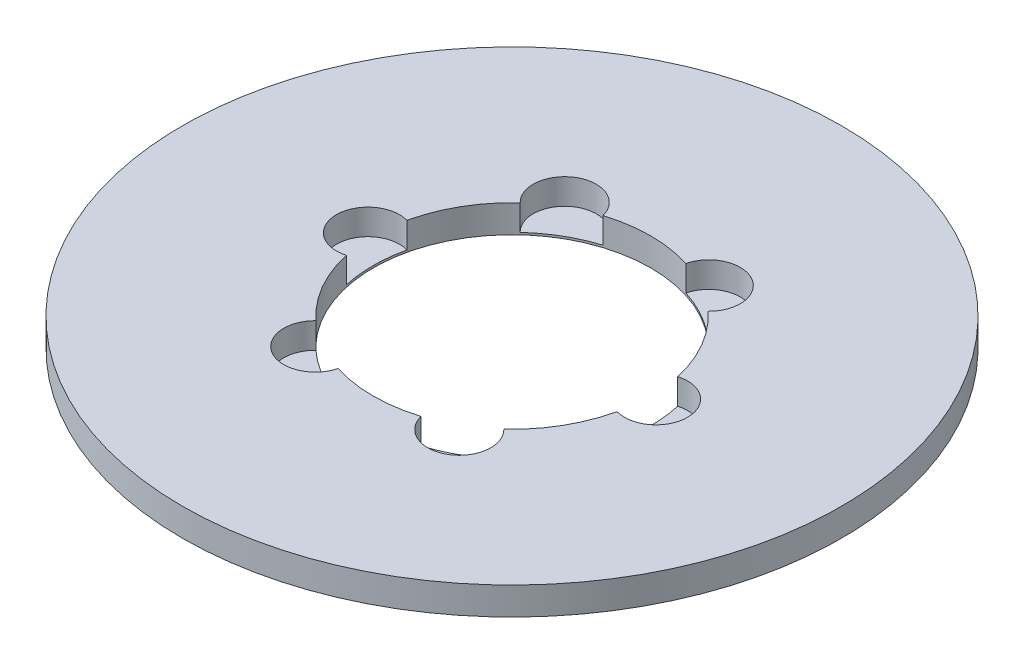
ISO-10303-21;
HEADER;
FILE_DESCRIPTION(('STEP AP214'),'2;1');
FILE_NAME('part.step','',(''),(''),'','','');
FILE_SCHEMA(('AUTOMOTIVE_DESIGN { 1 0 10303 214 1 1 1 1 }'));
ENDSEC;
DATA;
#1=APPLICATION_CONTEXT('core data for automotive mechanical design processes');
#2=APPLICATION_PROTOCOL_DEFINITION('international standard','automotive_design',2000,#1);
#3=PRODUCT_CONTEXT('',#1,'mechanical');
#4=PRODUCT('Part','Part','',(#3));
#5=PRODUCT_RELATED_PRODUCT_CATEGORY('part','',(#4));
#6=PRODUCT_DEFINITION_FORMATION('','',#4);
#7=PRODUCT_DEFINITION_CONTEXT('part definition',#1,'design');
#8=PRODUCT_DEFINITION('design','',#6,#7);
#9=PRODUCT_DEFINITION_SHAPE('','',#8);
#10=(LENGTH_UNIT() NAMED_UNIT(*) SI_UNIT(.MILLI.,.METRE.));
#11=(NAMED_UNIT(*) PLANE_ANGLE_UNIT() SI_UNIT($,.RADIAN.));
#12=(NAMED_UNIT(*) SI_UNIT($,.STERADIAN.) SOLID_ANGLE_UNIT());
#13=UNCERTAINTY_MEASURE_WITH_UNIT(LENGTH_MEASURE(1.E-05),#10,'distance_accuracy_value','');
#14=(GEOMETRIC_REPRESENTATION_CONTEXT(3) GLOBAL_UNCERTAINTY_ASSIGNED_CONTEXT((#13)) GLOBAL_UNIT_ASSIGNED_CONTEXT((#10,
#11,#12)) REPRESENTATION_CONTEXT('',''));
#15=CARTESIAN_POINT('',(0.,0.,0.));
#16=DIRECTION('',(0.,0.,1.));
#17=DIRECTION('',(1.,0.,0.));
#18=AXIS2_PLACEMENT_3D('',#15,#16,#17);
#19=CARTESIAN_POINT('',(0.,8.,0.));
#20=DIRECTION('',(0.,-1.,0.));
#21=DIRECTION('',(0.,0.,-1.));
#22=AXIS2_PLACEMENT_3D('',#19,#20,#21);
#23=CYLINDRICAL_SURFACE('',#22,95.);
#24=CARTESIAN_POINT('',(0.,8.,0.));
#25=DIRECTION('',(0.,1.,0.));
#26=DIRECTION('',(0.,0.,1.));
#27=AXIS2_PLACEMENT_3D('',#24,#25,#26);
#28=CIRCLE('',#27,95.);
#29=CARTESIAN_POINT('',(0.,8.,95.));
#30=VERTEX_POINT('',#29);
#31=EDGE_CURVE('E171',#30,#30,#28,.T.);
#32=ORIENTED_EDGE('',*,*,#31,.F.);
#33=EDGE_LOOP('',(#32));
#34=FACE_BOUND('',#33,.T.);
#35=CARTESIAN_POINT('',(0.,0.,0.));
#36=DIRECTION('',(0.,1.,0.));
#37=DIRECTION('',(0.,0.,1.));
#38=AXIS2_PLACEMENT_3D('',#35,#36,#37);
#39=CIRCLE('',#38,95.);
#40=CARTESIAN_POINT('',(0.,0.,95.));
#41=VERTEX_POINT('',#40);
#42=EDGE_CURVE('E157',#41,#41,#39,.T.);
#43=ORIENTED_EDGE('',*,*,#42,.T.);
#44=EDGE_LOOP('',(#43));
#45=FACE_BOUND('',#44,.T.);
#46=ADVANCED_FACE('F39',(#34,#45),#23,.T.);
#47=CARTESIAN_POINT('',(0.,8.,0.));
#48=DIRECTION('',(0.,1.,0.));
#49=DIRECTION('',(0.,0.,1.));
#50=AXIS2_PLACEMENT_3D('',#47,#48,#49);
#51=PLANE('',#50);
#52=CARTESIAN_POINT('',(-20.7594457086019,8.,-35.9564147042652));
#53=DIRECTION('',(0.,1.,0.));
#54=DIRECTION('',(-0.866025403784433,0.,0.50000000000001));
#55=AXIS2_PLACEMENT_3D('',#52,#53,#54);
#56=CIRCLE('',#55,9.08729981013371);
#57=CARTESIAN_POINT('',(-11.9469333377204,8.,-38.1742162175475));
#58=VERTEX_POINT('',#57);
#59=CARTESIAN_POINT('',(-27.0863743450965,8.,-29.4334558765582));
#60=VERTEX_POINT('',#59);
#61=EDGE_CURVE('E214',#58,#60,#56,.T.);
#62=ORIENTED_EDGE('',*,*,#61,.F.);
#63=CARTESIAN_POINT('',(0.,8.,0.));
#64=DIRECTION('',(0.,1.,0.));
#65=DIRECTION('',(0.,0.,1.));
#66=AXIS2_PLACEMENT_3D('',#63,#64,#65);
#67=CIRCLE('',#66,40.);
#68=CARTESIAN_POINT('',(11.9469333377196,8.,-38.1742162175477));
#69=VERTEX_POINT('',#68);
#70=EDGE_CURVE('E272',#69,#58,#67,.T.);
#71=ORIENTED_EDGE('',*,*,#70,.F.);
#72=CARTESIAN_POINT('',(20.7594457086011,8.,-35.9564147042656));
#73=DIRECTION('',(0.,1.,0.));
#74=DIRECTION('',(-0.866025403784443,0.,-0.499999999999992));
#75=AXIS2_PLACEMENT_3D('',#72,#73,#74);
#76=CIRCLE('',#75,9.08729981013371);
#77=CARTESIAN_POINT('',(27.0863743450959,8.,-29.4334558765588));
#78=VERTEX_POINT('',#77);
#79=EDGE_CURVE('E285',#78,#69,#76,.T.);
#80=ORIENTED_EDGE('',*,*,#79,.F.);
#81=CARTESIAN_POINT('',(39.0333076828161,8.,-8.7407603409891));
#82=VERTEX_POINT('',#81);
#83=EDGE_CURVE('E165',#82,#78,#67,.T.);
#84=ORIENTED_EDGE('',*,*,#83,.F.);
#85=CARTESIAN_POINT('',(41.518891417203,8.,0.));
#86=DIRECTION('',(0.,1.,0.));
#87=DIRECTION('',(0.,0.,-1.));
#88=AXIS2_PLACEMENT_3D('',#85,#86,#87);
#89=CIRCLE('',#88,9.08729981013371);
#90=CARTESIAN_POINT('',(39.0333076828161,8.,8.7407603409891));
#91=VERTEX_POINT('',#90);
#92=EDGE_CURVE('E281',#91,#82,#89,.T.);
#93=ORIENTED_EDGE('',*,*,#92,.F.);
#94=CARTESIAN_POINT('',(27.0863743450963,8.,29.4334558765584));
#95=VERTEX_POINT('',#94);
#96=EDGE_CURVE('E160',#95,#91,#67,.T.);
#97=ORIENTED_EDGE('',*,*,#96,.F.);
#98=CARTESIAN_POINT('',(20.7594457086016,8.,35.9564147042654));
#99=DIRECTION('',(0.,1.,0.));
#100=DIRECTION('',(0.866025403784436,0.,-0.500000000000004));
#101=AXIS2_PLACEMENT_3D('',#98,#99,#100);
#102=CIRCLE('',#101,9.08729981013371);
#103=CARTESIAN_POINT('',(11.9469333377202,8.,38.1742162175476));
#104=VERTEX_POINT('',#103);
#105=EDGE_CURVE('E154',#104,#95,#102,.T.);
#106=ORIENTED_EDGE('',*,*,#105,.F.);
#107=CARTESIAN_POINT('',(-11.9469333377199,8.,38.1742162175476));
#108=VERTEX_POINT('',#107);
#109=EDGE_CURVE('E150',#108,#104,#67,.T.);
#110=ORIENTED_EDGE('',*,*,#109,.F.);
#111=CARTESIAN_POINT('',(-20.7594457086014,8.,35.9564147042655));
#112=DIRECTION('',(0.,1.,0.));
#113=DIRECTION('',(0.86602540378444,0.,0.499999999999998));
#114=AXIS2_PLACEMENT_3D('',#111,#112,#113);
#115=CIRCLE('',#114,9.08729981013371);
#116=CARTESIAN_POINT('',(-27.0863743450961,8.,29.4334558765586));
#117=VERTEX_POINT('',#116);
#118=EDGE_CURVE('E127',#117,#108,#115,.T.);
#119=ORIENTED_EDGE('',*,*,#118,.F.);
#120=CARTESIAN_POINT('',(-39.0333076828161,8.,8.7407603409891));
#121=VERTEX_POINT('',#120);
#122=EDGE_CURVE('E156',#121,#117,#67,.T.);
#123=ORIENTED_EDGE('',*,*,#122,.F.);
#124=CARTESIAN_POINT('',(-41.518891417203,8.,0.));
#125=DIRECTION('',(0.,1.,0.));
#126=DIRECTION('',(0.,0.,1.));
#127=AXIS2_PLACEMENT_3D('',#124,#125,#126);
#128=CIRCLE('',#127,9.08729981013371);
#129=CARTESIAN_POINT('',(-39.0333076828161,8.,-8.7407603409891));
#130=VERTEX_POINT('',#129);
#131=EDGE_CURVE('E164',#130,#121,#128,.T.);
#132=ORIENTED_EDGE('',*,*,#131,.F.);
#133=EDGE_CURVE('E159',#60,#130,#67,.T.);
#134=ORIENTED_EDGE('',*,*,#133,.F.);
#135=EDGE_LOOP('',(#62,#71,#80,#84,#93,#97,#106,#110,#119,#123,#132,#134));
#136=FACE_BOUND('',#135,.T.);
#137=ORIENTED_EDGE('',*,*,#31,.T.);
#138=EDGE_LOOP('',(#137));
#139=FACE_BOUND('',#138,.T.);
#140=ADVANCED_FACE('F155',(#136,#139),#51,.T.);
#141=CARTESIAN_POINT('',(0.,0.,0.));
#142=DIRECTION('',(0.,1.,0.));
#143=DIRECTION('',(0.,0.,1.));
#144=AXIS2_PLACEMENT_3D('',#141,#142,#143);
#145=PLANE('',#144);
#146=CARTESIAN_POINT('',(0.,0.,0.));
#147=DIRECTION('',(0.,1.,0.));
#148=DIRECTION('',(0.,0.,1.));
#149=AXIS2_PLACEMENT_3D('',#146,#147,#148);
#150=CIRCLE('',#149,40.);
#151=CARTESIAN_POINT('',(0.,0.,40.));
#152=VERTEX_POINT('',#151);
#153=EDGE_CURVE('E170',#152,#152,#150,.T.);
#154=ORIENTED_EDGE('',*,*,#153,.T.);
#155=EDGE_LOOP('',(#154));
#156=FACE_BOUND('',#155,.T.);
#157=ORIENTED_EDGE('',*,*,#42,.F.);
#158=EDGE_LOOP('',(#157));
#159=FACE_BOUND('',#158,.T.);
#160=ADVANCED_FACE('F232',(#156,#159),#145,.F.);
#161=CARTESIAN_POINT('',(0.,8.,0.));
#162=DIRECTION('',(0.,-1.,0.));
#163=DIRECTION('',(0.,0.,-1.));
#164=AXIS2_PLACEMENT_3D('',#161,#162,#163);
#165=CYLINDRICAL_SURFACE('',#164,40.);
#166=DIRECTION('',(0.,1.,0.));
#167=VECTOR('',#166,1.);
#168=CARTESIAN_POINT('',(-11.9469333377204,4.30576343459807,-38.1742162175475));
#169=LINE('',#168,#167);
#170=CARTESIAN_POINT('',(-11.9469333377204,0.611526869196147,-38.1742162175475));
#171=VERTEX_POINT('',#170);
#172=EDGE_CURVE('E11',#171,#58,#169,.T.);
#173=ORIENTED_EDGE('',*,*,#172,.F.);
#174=CARTESIAN_POINT('',(0.,0.611526869196147,0.));
#175=DIRECTION('',(0.,1.,0.));
#176=DIRECTION('',(0.,0.,1.));
#177=AXIS2_PLACEMENT_3D('',#174,#175,#176);
#178=CIRCLE('',#177,40.);
#179=CARTESIAN_POINT('',(-27.0863743450965,0.611526869196147,-29.4334558765582));
#180=VERTEX_POINT('',#179);
#181=EDGE_CURVE('E209',#171,#180,#178,.T.);
#182=ORIENTED_EDGE('',*,*,#181,.T.);
#183=DIRECTION('',(0.,1.,0.));
#184=VECTOR('',#183,1.);
#185=CARTESIAN_POINT('',(-27.0863743450965,4.30576343459807,-29.4334558765582));
#186=LINE('',#185,#184);
#187=EDGE_CURVE('E46',#60,#180,#186,.F.);
#188=ORIENTED_EDGE('',*,*,#187,.F.);
#189=ORIENTED_EDGE('',*,*,#133,.T.);
#190=DIRECTION('',(0.,1.,0.));
#191=VECTOR('',#190,1.);
#192=CARTESIAN_POINT('',(-39.0333076828161,4.30576343459807,-8.7407603409891));
#193=LINE('',#192,#191);
#194=CARTESIAN_POINT('',(-39.0333076828161,0.611526869196147,-8.7407603409891));
#195=VERTEX_POINT('',#194);
#196=EDGE_CURVE('E185',#195,#130,#193,.T.);
#197=ORIENTED_EDGE('',*,*,#196,.F.);
#198=CARTESIAN_POINT('',(0.,0.611526869196147,0.));
#199=DIRECTION('',(0.,1.,0.));
#200=DIRECTION('',(0.,0.,1.));
#201=AXIS2_PLACEMENT_3D('',#198,#199,#200);
#202=CIRCLE('',#201,40.);
#203=CARTESIAN_POINT('',(-39.0333076828161,0.611526869196147,8.7407603409891));
#204=VERTEX_POINT('',#203);
#205=EDGE_CURVE('E173',#195,#204,#202,.T.);
#206=ORIENTED_EDGE('',*,*,#205,.T.);
#207=DIRECTION('',(0.,1.,0.));
#208=VECTOR('',#207,1.);
#209=CARTESIAN_POINT('',(-39.0333076828161,4.30576343459807,8.7407603409891));
#210=LINE('',#209,#208);
#211=EDGE_CURVE('E178',#121,#204,#210,.F.);
#212=ORIENTED_EDGE('',*,*,#211,.F.);
#213=ORIENTED_EDGE('',*,*,#122,.T.);
#214=DIRECTION('',(0.,1.,0.));
#215=VECTOR('',#214,1.);
#216=CARTESIAN_POINT('',(-27.0863743450961,4.30576343459807,29.4334558765586));
#217=LINE('',#216,#215);
#218=CARTESIAN_POINT('',(-27.0863743450961,0.611526869196147,29.4334558765586));
#219=VERTEX_POINT('',#218);
#220=EDGE_CURVE('E132',#219,#117,#217,.T.);
#221=ORIENTED_EDGE('',*,*,#220,.F.);
#222=CARTESIAN_POINT('',(0.,0.611526869196147,0.));
#223=DIRECTION('',(0.,1.,0.));
#224=DIRECTION('',(0.,0.,1.));
#225=AXIS2_PLACEMENT_3D('',#222,#223,#224);
#226=CIRCLE('',#225,40.);
#227=CARTESIAN_POINT('',(-11.9469333377199,0.611526869196147,38.1742162175476));
#228=VERTEX_POINT('',#227);
#229=EDGE_CURVE('E146',#219,#228,#226,.T.);
#230=ORIENTED_EDGE('',*,*,#229,.T.);
#231=DIRECTION('',(0.,1.,0.));
#232=VECTOR('',#231,1.);
#233=CARTESIAN_POINT('',(-11.9469333377199,4.30576343459807,38.1742162175476));
#234=LINE('',#233,#232);
#235=EDGE_CURVE('E128',#108,#228,#234,.F.);
#236=ORIENTED_EDGE('',*,*,#235,.F.);
#237=ORIENTED_EDGE('',*,*,#109,.T.);
#238=DIRECTION('',(0.,1.,0.));
#239=VECTOR('',#238,1.);
#240=CARTESIAN_POINT('',(11.9469333377202,4.30576343459807,38.1742162175476));
#241=LINE('',#240,#239);
#242=CARTESIAN_POINT('',(11.9469333377202,0.611526869196147,38.1742162175476));
#243=VERTEX_POINT('',#242);
#244=EDGE_CURVE('E192',#243,#104,#241,.T.);
#245=ORIENTED_EDGE('',*,*,#244,.F.);
#246=CARTESIAN_POINT('',(0.,0.611526869196147,0.));
#247=DIRECTION('',(0.,1.,0.));
#248=DIRECTION('',(0.,0.,1.));
#249=AXIS2_PLACEMENT_3D('',#246,#247,#248);
#250=CIRCLE('',#249,40.);
#251=CARTESIAN_POINT('',(27.0863743450963,0.611526869196147,29.4334558765584));
#252=VERTEX_POINT('',#251);
#253=EDGE_CURVE('E190',#243,#252,#250,.T.);
#254=ORIENTED_EDGE('',*,*,#253,.T.);
#255=DIRECTION('',(0.,1.,0.));
#256=VECTOR('',#255,1.);
#257=CARTESIAN_POINT('',(27.0863743450963,4.30576343459807,29.4334558765584));
#258=LINE('',#257,#256);
#259=EDGE_CURVE('E189',#95,#252,#258,.F.);
#260=ORIENTED_EDGE('',*,*,#259,.F.);
#261=ORIENTED_EDGE('',*,*,#96,.T.);
#262=DIRECTION('',(0.,1.,0.));
#263=VECTOR('',#262,1.);
#264=CARTESIAN_POINT('',(39.0333076828161,4.30576343459807,8.7407603409891));
#265=LINE('',#264,#263);
#266=CARTESIAN_POINT('',(39.0333076828161,0.611526869196147,8.7407603409891));
#267=VERTEX_POINT('',#266);
#268=EDGE_CURVE('E203',#267,#91,#265,.T.);
#269=ORIENTED_EDGE('',*,*,#268,.F.);
#270=CARTESIAN_POINT('',(0.,0.611526869196147,0.));
#271=DIRECTION('',(0.,1.,0.));
#272=DIRECTION('',(0.,0.,1.));
#273=AXIS2_PLACEMENT_3D('',#270,#271,#272);
#274=CIRCLE('',#273,40.);
#275=CARTESIAN_POINT('',(39.0333076828161,0.611526869196147,-8.7407603409891));
#276=VERTEX_POINT('',#275);
#277=EDGE_CURVE('E194',#267,#276,#274,.T.);
#278=ORIENTED_EDGE('',*,*,#277,.T.);
#279=DIRECTION('',(0.,1.,0.));
#280=VECTOR('',#279,1.);
#281=CARTESIAN_POINT('',(39.0333076828161,4.30576343459807,-8.7407603409891));
#282=LINE('',#281,#280);
#283=EDGE_CURVE('E196',#82,#276,#282,.F.);
#284=ORIENTED_EDGE('',*,*,#283,.F.);
#285=ORIENTED_EDGE('',*,*,#83,.T.);
#286=DIRECTION('',(0.,1.,0.));
#287=VECTOR('',#286,1.);
#288=CARTESIAN_POINT('',(27.0863743450959,4.30576343459807,-29.4334558765588));
#289=LINE('',#288,#287);
#290=CARTESIAN_POINT('',(27.0863743450959,0.611526869196147,-29.4334558765588));
#291=VERTEX_POINT('',#290);
#292=EDGE_CURVE('E208',#291,#78,#289,.T.);
#293=ORIENTED_EDGE('',*,*,#292,.F.);
#294=CARTESIAN_POINT('',(0.,0.611526869196147,0.));
#295=DIRECTION('',(0.,1.,0.));
#296=DIRECTION('',(0.,0.,1.));
#297=AXIS2_PLACEMENT_3D('',#294,#295,#296);
#298=CIRCLE('',#297,40.);
#299=CARTESIAN_POINT('',(11.9469333377196,0.611526869196147,-38.1742162175477));
#300=VERTEX_POINT('',#299);
#301=EDGE_CURVE('E201',#291,#300,#298,.T.);
#302=ORIENTED_EDGE('',*,*,#301,.T.);
#303=DIRECTION('',(0.,1.,0.));
#304=VECTOR('',#303,1.);
#305=CARTESIAN_POINT('',(11.9469333377196,4.30576343459807,-38.1742162175477));
#306=LINE('',#305,#304);
#307=EDGE_CURVE('E206',#69,#300,#306,.F.);
#308=ORIENTED_EDGE('',*,*,#307,.F.);
#309=ORIENTED_EDGE('',*,*,#70,.T.);
#310=EDGE_LOOP('',(#173,#182,#188,#189,#197,#206,#212,#213,#221,#230,#236,#237,#245,#254,#260,
#261,#269,#278,#284,#285,#293,#302,#308,#309));
#311=FACE_BOUND('',#310,.T.);
#312=ORIENTED_EDGE('',*,*,#153,.F.);
#313=EDGE_LOOP('',(#312));
#314=FACE_BOUND('',#313,.T.);
#315=ADVANCED_FACE('F145',(#311,#314),#165,.F.);
#316=CARTESIAN_POINT('',(-41.518891417203,0.611526869196147,0.));
#317=DIRECTION('',(0.,1.,0.));
#318=DIRECTION('',(0.,0.,1.));
#319=AXIS2_PLACEMENT_3D('',#316,#317,#318);
#320=CYLINDRICAL_SURFACE('',#319,9.08729981013371);
#321=ORIENTED_EDGE('',*,*,#196,.T.);
#322=ORIENTED_EDGE('',*,*,#131,.T.);
#323=ORIENTED_EDGE('',*,*,#211,.T.);
#324=CARTESIAN_POINT('',(-41.518891417203,0.611526869196147,0.));
#325=DIRECTION('',(0.,1.,0.));
#326=DIRECTION('',(0.,0.,1.));
#327=AXIS2_PLACEMENT_3D('',#324,#325,#326);
#328=CIRCLE('',#327,9.08729981013371);
#329=EDGE_CURVE('E168',#195,#204,#328,.T.);
#330=ORIENTED_EDGE('',*,*,#329,.F.);
#331=EDGE_LOOP('',(#321,#322,#323,#330));
#332=FACE_BOUND('',#331,.T.);
#333=ADVANCED_FACE('F243',(#332),#320,.F.);
#334=CARTESIAN_POINT('',(-41.518891417203,0.611526869196147,0.));
#335=DIRECTION('',(0.,1.,0.));
#336=DIRECTION('',(0.,0.,1.));
#337=AXIS2_PLACEMENT_3D('',#334,#335,#336);
#338=PLANE('',#337);
#339=ORIENTED_EDGE('',*,*,#329,.T.);
#340=ORIENTED_EDGE('',*,*,#205,.F.);
#341=EDGE_LOOP('',(#339,#340));
#342=FACE_BOUND('',#341,.T.);
#343=ADVANCED_FACE('F247',(#342),#338,.T.);
#344=CARTESIAN_POINT('',(-20.7594457086014,0.611526869196147,35.9564147042655));
#345=DIRECTION('',(0.,1.,0.));
#346=DIRECTION('',(0.,0.,1.));
#347=AXIS2_PLACEMENT_3D('',#344,#345,#346);
#348=CYLINDRICAL_SURFACE('',#347,9.08729981013371);
#349=ORIENTED_EDGE('',*,*,#220,.T.);
#350=ORIENTED_EDGE('',*,*,#118,.T.);
#351=ORIENTED_EDGE('',*,*,#235,.T.);
#352=CARTESIAN_POINT('',(-20.7594457086014,0.611526869196147,35.9564147042655));
#353=DIRECTION('',(0.,1.,0.));
#354=DIRECTION('',(0.86602540378444,0.,0.499999999999998));
#355=AXIS2_PLACEMENT_3D('',#352,#353,#354);
#356=CIRCLE('',#355,9.08729981013371);
#357=EDGE_CURVE('E137',#219,#228,#356,.T.);
#358=ORIENTED_EDGE('',*,*,#357,.F.);
#359=EDGE_LOOP('',(#349,#350,#351,#358));
#360=FACE_BOUND('',#359,.T.);
#361=ADVANCED_FACE('F126',(#360),#348,.F.);
#362=CARTESIAN_POINT('',(-20.7594457086014,0.611526869196147,35.9564147042655));
#363=DIRECTION('',(0.,1.,0.));
#364=DIRECTION('',(0.86602540378444,0.,0.499999999999998));
#365=AXIS2_PLACEMENT_3D('',#362,#363,#364);
#366=PLANE('',#365);
#367=ORIENTED_EDGE('',*,*,#357,.T.);
#368=ORIENTED_EDGE('',*,*,#229,.F.);
#369=EDGE_LOOP('',(#367,#368));
#370=FACE_BOUND('',#369,.T.);
#371=ADVANCED_FACE('F254',(#370),#366,.T.);
#372=CARTESIAN_POINT('',(20.7594457086016,0.611526869196147,35.9564147042654));
#373=DIRECTION('',(0.,1.,0.));
#374=DIRECTION('',(0.,0.,1.));
#375=AXIS2_PLACEMENT_3D('',#372,#373,#374);
#376=CYLINDRICAL_SURFACE('',#375,9.08729981013371);
#377=ORIENTED_EDGE('',*,*,#244,.T.);
#378=ORIENTED_EDGE('',*,*,#105,.T.);
#379=ORIENTED_EDGE('',*,*,#259,.T.);
#380=CARTESIAN_POINT('',(20.7594457086016,0.611526869196147,35.9564147042654));
#381=DIRECTION('',(0.,1.,0.));
#382=DIRECTION('',(0.866025403784436,0.,-0.500000000000004));
#383=AXIS2_PLACEMENT_3D('',#380,#381,#382);
#384=CIRCLE('',#383,9.08729981013371);
#385=EDGE_CURVE('E138',#243,#252,#384,.T.);
#386=ORIENTED_EDGE('',*,*,#385,.F.);
#387=EDGE_LOOP('',(#377,#378,#379,#386));
#388=FACE_BOUND('',#387,.T.);
#389=ADVANCED_FACE('F260',(#388),#376,.F.);
#390=CARTESIAN_POINT('',(20.7594457086016,0.611526869196147,35.9564147042654));
#391=DIRECTION('',(0.,1.,0.));
#392=DIRECTION('',(0.866025403784436,0.,-0.500000000000004));
#393=AXIS2_PLACEMENT_3D('',#390,#391,#392);
#394=PLANE('',#393);
#395=ORIENTED_EDGE('',*,*,#385,.T.);
#396=ORIENTED_EDGE('',*,*,#253,.F.);
#397=EDGE_LOOP('',(#395,#396));
#398=FACE_BOUND('',#397,.T.);
#399=ADVANCED_FACE('F265',(#398),#394,.T.);
#400=CARTESIAN_POINT('',(41.518891417203,0.611526869196147,0.));
#401=DIRECTION('',(0.,1.,0.));
#402=DIRECTION('',(0.,0.,1.));
#403=AXIS2_PLACEMENT_3D('',#400,#401,#402);
#404=CYLINDRICAL_SURFACE('',#403,9.08729981013371);
#405=ORIENTED_EDGE('',*,*,#268,.T.);
#406=ORIENTED_EDGE('',*,*,#92,.T.);
#407=ORIENTED_EDGE('',*,*,#283,.T.);
#408=CARTESIAN_POINT('',(41.518891417203,0.611526869196147,0.));
#409=DIRECTION('',(0.,1.,0.));
#410=DIRECTION('',(0.,0.,-1.));
#411=AXIS2_PLACEMENT_3D('',#408,#409,#410);
#412=CIRCLE('',#411,9.08729981013371);
#413=EDGE_CURVE('E287',#267,#276,#412,.T.);
#414=ORIENTED_EDGE('',*,*,#413,.F.);
#415=EDGE_LOOP('',(#405,#406,#407,#414));
#416=FACE_BOUND('',#415,.T.);
#417=ADVANCED_FACE('F300',(#416),#404,.F.);
#418=CARTESIAN_POINT('',(41.518891417203,0.611526869196147,0.));
#419=DIRECTION('',(0.,1.,0.));
#420=DIRECTION('',(0.,0.,-1.));
#421=AXIS2_PLACEMENT_3D('',#418,#419,#420);
#422=PLANE('',#421);
#423=ORIENTED_EDGE('',*,*,#413,.T.);
#424=ORIENTED_EDGE('',*,*,#277,.F.);
#425=EDGE_LOOP('',(#423,#424));
#426=FACE_BOUND('',#425,.T.);
#427=ADVANCED_FACE('F298',(#426),#422,.T.);
#428=CARTESIAN_POINT('',(20.7594457086011,0.611526869196147,-35.9564147042656));
#429=DIRECTION('',(0.,1.,0.));
#430=DIRECTION('',(0.,0.,1.));
#431=AXIS2_PLACEMENT_3D('',#428,#429,#430);
#432=CYLINDRICAL_SURFACE('',#431,9.08729981013371);
#433=ORIENTED_EDGE('',*,*,#292,.T.);
#434=ORIENTED_EDGE('',*,*,#79,.T.);
#435=ORIENTED_EDGE('',*,*,#307,.T.);
#436=CARTESIAN_POINT('',(20.7594457086011,0.611526869196147,-35.9564147042656));
#437=DIRECTION('',(0.,1.,0.));
#438=DIRECTION('',(-0.866025403784443,0.,-0.499999999999992));
#439=AXIS2_PLACEMENT_3D('',#436,#437,#438);
#440=CIRCLE('',#439,9.08729981013371);
#441=EDGE_CURVE('E56',#291,#300,#440,.T.);
#442=ORIENTED_EDGE('',*,*,#441,.F.);
#443=EDGE_LOOP('',(#433,#434,#435,#442));
#444=FACE_BOUND('',#443,.T.);
#445=ADVANCED_FACE('F301',(#444),#432,.F.);
#446=CARTESIAN_POINT('',(20.7594457086011,0.611526869196147,-35.9564147042656));
#447=DIRECTION('',(0.,1.,0.));
#448=DIRECTION('',(-0.866025403784443,0.,-0.499999999999992));
#449=AXIS2_PLACEMENT_3D('',#446,#447,#448);
#450=PLANE('',#449);
#451=ORIENTED_EDGE('',*,*,#441,.T.);
#452=ORIENTED_EDGE('',*,*,#301,.F.);
#453=EDGE_LOOP('',(#451,#452));
#454=FACE_BOUND('',#453,.T.);
#455=ADVANCED_FACE('F221',(#454),#450,.T.);
#456=CARTESIAN_POINT('',(-20.7594457086019,0.611526869196147,-35.9564147042652));
#457=DIRECTION('',(0.,1.,0.));
#458=DIRECTION('',(0.,0.,1.));
#459=AXIS2_PLACEMENT_3D('',#456,#457,#458);
#460=CYLINDRICAL_SURFACE('',#459,9.08729981013371);
#461=ORIENTED_EDGE('',*,*,#172,.T.);
#462=ORIENTED_EDGE('',*,*,#61,.T.);
#463=ORIENTED_EDGE('',*,*,#187,.T.);
#464=CARTESIAN_POINT('',(-20.7594457086019,0.611526869196147,-35.9564147042652));
#465=DIRECTION('',(0.,1.,0.));
#466=DIRECTION('',(-0.866025403784433,0.,0.50000000000001));
#467=AXIS2_PLACEMENT_3D('',#464,#465,#466);
#468=CIRCLE('',#467,9.08729981013371);
#469=EDGE_CURVE('E55',#171,#180,#468,.T.);
#470=ORIENTED_EDGE('',*,*,#469,.F.);
#471=EDGE_LOOP('',(#461,#462,#463,#470));
#472=FACE_BOUND('',#471,.T.);
#473=ADVANCED_FACE('F212',(#472),#460,.F.);
#474=CARTESIAN_POINT('',(-20.7594457086019,0.611526869196147,-35.9564147042652));
#475=DIRECTION('',(0.,1.,0.));
#476=DIRECTION('',(-0.866025403784433,0.,0.50000000000001));
#477=AXIS2_PLACEMENT_3D('',#474,#475,#476);
#478=PLANE('',#477);
#479=ORIENTED_EDGE('',*,*,#469,.T.);
#480=ORIENTED_EDGE('',*,*,#181,.F.);
#481=EDGE_LOOP('',(#479,#480));
#482=FACE_BOUND('',#481,.T.);
#483=ADVANCED_FACE('F217',(#482),#478,.T.);
#484=CLOSED_SHELL('',(#46,#140,#160,#315,#333,#343,#361,#371,#389,#399,#417,#427,#445,#455,#473,#483));
#485=MANIFOLD_SOLID_BREP('B2',#484);
#486=ADVANCED_BREP_SHAPE_REPRESENTATION('',(#18,#485),#14);
#487=SHAPE_DEFINITION_REPRESENTATION(#9,#486);
ENDSEC;
END-ISO-10303-21;
